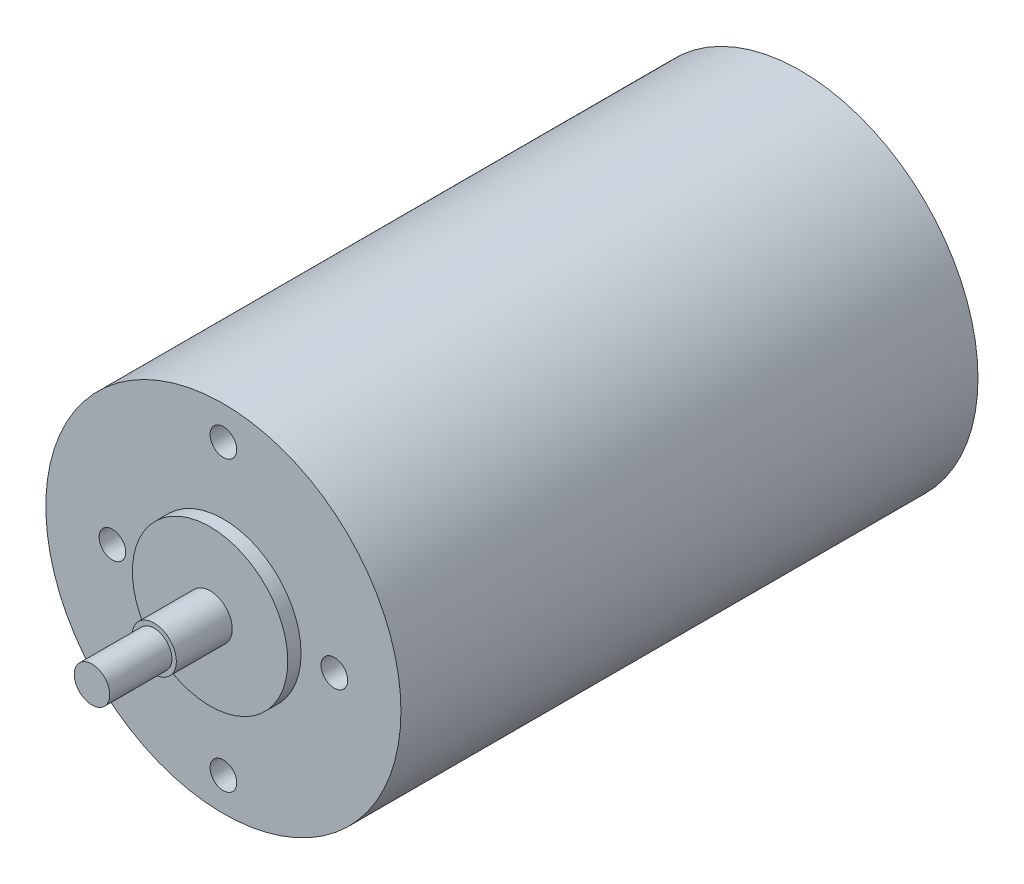
ISO-10303-21;
HEADER;
FILE_DESCRIPTION(('STEP AP214'),'2;1');
FILE_NAME('part.step','',(''),(''),'','','');
FILE_SCHEMA(('AUTOMOTIVE_DESIGN { 1 0 10303 214 1 1 1 1 }'));
ENDSEC;
DATA;
#1=APPLICATION_CONTEXT('core data for automotive mechanical design processes');
#2=APPLICATION_PROTOCOL_DEFINITION('international standard','automotive_design',2000,#1);
#3=PRODUCT_CONTEXT('',#1,'mechanical');
#4=PRODUCT('Part','Part','',(#3));
#5=PRODUCT_RELATED_PRODUCT_CATEGORY('part','',(#4));
#6=PRODUCT_DEFINITION_FORMATION('','',#4);
#7=PRODUCT_DEFINITION_CONTEXT('part definition',#1,'design');
#8=PRODUCT_DEFINITION('design','',#6,#7);
#9=PRODUCT_DEFINITION_SHAPE('','',#8);
#10=(LENGTH_UNIT() NAMED_UNIT(*) SI_UNIT(.MILLI.,.METRE.));
#11=(NAMED_UNIT(*) PLANE_ANGLE_UNIT() SI_UNIT($,.RADIAN.));
#12=(NAMED_UNIT(*) SI_UNIT($,.STERADIAN.) SOLID_ANGLE_UNIT());
#13=UNCERTAINTY_MEASURE_WITH_UNIT(LENGTH_MEASURE(1.E-05),#10,'distance_accuracy_value','');
#14=(GEOMETRIC_REPRESENTATION_CONTEXT(3) GLOBAL_UNCERTAINTY_ASSIGNED_CONTEXT((#13)) GLOBAL_UNIT_ASSIGNED_CONTEXT((#10,
#11,#12)) REPRESENTATION_CONTEXT('',''));
#15=CARTESIAN_POINT('',(0.,0.,0.));
#16=DIRECTION('',(0.,0.,1.));
#17=DIRECTION('',(1.,0.,0.));
#18=AXIS2_PLACEMENT_3D('',#15,#16,#17);
#19=CARTESIAN_POINT('',(0.,0.,-1.5));
#20=DIRECTION('',(0.,0.,-1.));
#21=DIRECTION('',(-1.,0.,0.));
#22=AXIS2_PLACEMENT_3D('',#19,#20,#21);
#23=PLANE('',#22);
#24=CARTESIAN_POINT('',(0.,0.,-1.5));
#25=DIRECTION('',(0.,0.,-1.));
#26=DIRECTION('',(-1.,0.,0.));
#27=AXIS2_PLACEMENT_3D('',#24,#25,#26);
#28=CIRCLE('',#27,8.75);
#29=CARTESIAN_POINT('',(-8.75,0.,-1.5));
#30=VERTEX_POINT('',#29);
#31=EDGE_CURVE('E46',#30,#30,#28,.T.);
#32=ORIENTED_EDGE('',*,*,#31,.T.);
#33=EDGE_LOOP('',(#32));
#34=FACE_BOUND('',#33,.T.);
#35=CARTESIAN_POINT('',(0.,0.,-1.5));
#36=DIRECTION('',(0.,0.,-1.));
#37=DIRECTION('',(-1.,0.,0.));
#38=AXIS2_PLACEMENT_3D('',#35,#36,#37);
#39=CIRCLE('',#38,2.5);
#40=CARTESIAN_POINT('',(-2.5,0.,-1.5));
#41=VERTEX_POINT('',#40);
#42=EDGE_CURVE('E69',#41,#41,#39,.T.);
#43=ORIENTED_EDGE('',*,*,#42,.F.);
#44=EDGE_LOOP('',(#43));
#45=FACE_BOUND('',#44,.T.);
#46=ADVANCED_FACE('F30',(#34,#45),#23,.T.);
#47=CARTESIAN_POINT('',(0.,0.,72.8));
#48=DIRECTION('',(0.,0.,1.));
#49=DIRECTION('',(1.,0.,0.));
#50=AXIS2_PLACEMENT_3D('',#47,#48,#49);
#51=PLANE('',#50);
#52=CARTESIAN_POINT('',(0.,0.,72.8));
#53=DIRECTION('',(0.,0.,1.));
#54=DIRECTION('',(1.,0.,0.));
#55=AXIS2_PLACEMENT_3D('',#52,#53,#54);
#56=CIRCLE('',#55,2.5);
#57=CARTESIAN_POINT('',(2.5,0.,72.8));
#58=VERTEX_POINT('',#57);
#59=EDGE_CURVE('E54',#58,#58,#56,.T.);
#60=ORIENTED_EDGE('',*,*,#59,.T.);
#61=EDGE_LOOP('',(#60));
#62=FACE_BOUND('',#61,.T.);
#63=CARTESIAN_POINT('',(0.,0.,72.8));
#64=DIRECTION('',(0.,0.,1.));
#65=DIRECTION('',(1.,0.,0.));
#66=AXIS2_PLACEMENT_3D('',#63,#64,#65);
#67=CIRCLE('',#66,2.);
#68=CARTESIAN_POINT('',(2.,0.,72.8));
#69=VERTEX_POINT('',#68);
#70=EDGE_CURVE('E63',#69,#69,#67,.T.);
#71=ORIENTED_EDGE('',*,*,#70,.F.);
#72=EDGE_LOOP('',(#71));
#73=FACE_BOUND('',#72,.T.);
#74=ADVANCED_FACE('F141',(#62,#73),#51,.T.);
#75=CARTESIAN_POINT('',(0.,0.,66.5));
#76=DIRECTION('',(0.,0.,1.));
#77=DIRECTION('',(1.,0.,0.));
#78=AXIS2_PLACEMENT_3D('',#75,#76,#77);
#79=PLANE('',#78);
#80=CARTESIAN_POINT('',(0.,0.,66.5));
#81=DIRECTION('',(0.,0.,1.));
#82=DIRECTION('',(1.,0.,0.));
#83=AXIS2_PLACEMENT_3D('',#80,#81,#82);
#84=CIRCLE('',#83,8.75);
#85=CARTESIAN_POINT('',(8.75,0.,66.5));
#86=VERTEX_POINT('',#85);
#87=EDGE_CURVE('E50',#86,#86,#84,.T.);
#88=ORIENTED_EDGE('',*,*,#87,.T.);
#89=EDGE_LOOP('',(#88));
#90=FACE_BOUND('',#89,.T.);
#91=CARTESIAN_POINT('',(0.,0.,66.5));
#92=DIRECTION('',(0.,0.,1.));
#93=DIRECTION('',(1.,0.,0.));
#94=AXIS2_PLACEMENT_3D('',#91,#92,#93);
#95=CIRCLE('',#94,2.5);
#96=CARTESIAN_POINT('',(2.5,0.,66.5));
#97=VERTEX_POINT('',#96);
#98=EDGE_CURVE('E57',#97,#97,#95,.T.);
#99=ORIENTED_EDGE('',*,*,#98,.F.);
#100=EDGE_LOOP('',(#99));
#101=FACE_BOUND('',#100,.T.);
#102=ADVANCED_FACE('F112',(#90,#101),#79,.T.);
#103=CARTESIAN_POINT('',(0.,0.,65.));
#104=DIRECTION('',(0.,0.,1.));
#105=DIRECTION('',(1.,0.,0.));
#106=AXIS2_PLACEMENT_3D('',#103,#104,#105);
#107=PLANE('',#106);
#108=CARTESIAN_POINT('',(0.,-16.25,65.));
#109=DIRECTION('',(0.,0.,1.));
#110=DIRECTION('',(1.,0.,0.));
#111=AXIS2_PLACEMENT_3D('',#108,#109,#110);
#112=CIRCLE('',#111,1.5);
#113=CARTESIAN_POINT('',(1.5,-16.25,65.));
#114=VERTEX_POINT('',#113);
#115=EDGE_CURVE('E93',#114,#114,#112,.T.);
#116=ORIENTED_EDGE('',*,*,#115,.F.);
#117=EDGE_LOOP('',(#116));
#118=FACE_BOUND('',#117,.T.);
#119=CARTESIAN_POINT('',(0.,16.25,65.));
#120=DIRECTION('',(0.,0.,1.));
#121=DIRECTION('',(1.,0.,0.));
#122=AXIS2_PLACEMENT_3D('',#119,#120,#121);
#123=CIRCLE('',#122,1.5);
#124=CARTESIAN_POINT('',(1.5,16.25,65.));
#125=VERTEX_POINT('',#124);
#126=EDGE_CURVE('E87',#125,#125,#123,.T.);
#127=ORIENTED_EDGE('',*,*,#126,.F.);
#128=EDGE_LOOP('',(#127));
#129=FACE_BOUND('',#128,.T.);
#130=CARTESIAN_POINT('',(12.5,0.,65.));
#131=DIRECTION('',(0.,0.,1.));
#132=DIRECTION('',(1.,0.,0.));
#133=AXIS2_PLACEMENT_3D('',#130,#131,#132);
#134=CIRCLE('',#133,1.5);
#135=CARTESIAN_POINT('',(14.,0.,65.));
#136=VERTEX_POINT('',#135);
#137=EDGE_CURVE('E81',#136,#136,#134,.T.);
#138=ORIENTED_EDGE('',*,*,#137,.F.);
#139=EDGE_LOOP('',(#138));
#140=FACE_BOUND('',#139,.T.);
#141=CARTESIAN_POINT('',(-12.5,0.,65.));
#142=DIRECTION('',(0.,0.,1.));
#143=DIRECTION('',(1.,0.,0.));
#144=AXIS2_PLACEMENT_3D('',#141,#142,#143);
#145=CIRCLE('',#144,1.5);
#146=CARTESIAN_POINT('',(-11.,0.,65.));
#147=VERTEX_POINT('',#146);
#148=EDGE_CURVE('E75',#147,#147,#145,.T.);
#149=ORIENTED_EDGE('',*,*,#148,.F.);
#150=EDGE_LOOP('',(#149));
#151=FACE_BOUND('',#150,.T.);
#152=CARTESIAN_POINT('',(0.,0.,65.));
#153=DIRECTION('',(0.,0.,1.));
#154=DIRECTION('',(1.,0.,0.));
#155=AXIS2_PLACEMENT_3D('',#152,#153,#154);
#156=CIRCLE('',#155,20.);
#157=CARTESIAN_POINT('',(20.,0.,65.));
#158=VERTEX_POINT('',#157);
#159=EDGE_CURVE('E37',#158,#158,#156,.T.);
#160=ORIENTED_EDGE('',*,*,#159,.T.);
#161=EDGE_LOOP('',(#160));
#162=FACE_BOUND('',#161,.T.);
#163=CARTESIAN_POINT('',(0.,0.,65.));
#164=DIRECTION('',(0.,0.,1.));
#165=DIRECTION('',(1.,0.,0.));
#166=AXIS2_PLACEMENT_3D('',#163,#164,#165);
#167=CIRCLE('',#166,8.75);
#168=CARTESIAN_POINT('',(8.75,0.,65.));
#169=VERTEX_POINT('',#168);
#170=EDGE_CURVE('E51',#169,#169,#167,.T.);
#171=ORIENTED_EDGE('',*,*,#170,.F.);
#172=EDGE_LOOP('',(#171));
#173=FACE_BOUND('',#172,.T.);
#174=ADVANCED_FACE('F108',(#118,#129,#140,#151,#162,#173),#107,.T.);
#175=CARTESIAN_POINT('',(0.,0.,0.));
#176=DIRECTION('',(0.,0.,1.));
#177=DIRECTION('',(1.,0.,0.));
#178=AXIS2_PLACEMENT_3D('',#175,#176,#177);
#179=PLANE('',#178);
#180=CARTESIAN_POINT('',(0.,0.,0.));
#181=DIRECTION('',(0.,0.,1.));
#182=DIRECTION('',(1.,0.,0.));
#183=AXIS2_PLACEMENT_3D('',#180,#181,#182);
#184=CIRCLE('',#183,20.);
#185=CARTESIAN_POINT('',(20.,0.,0.));
#186=VERTEX_POINT('',#185);
#187=EDGE_CURVE('E41',#186,#186,#184,.T.);
#188=ORIENTED_EDGE('',*,*,#187,.F.);
#189=EDGE_LOOP('',(#188));
#190=FACE_BOUND('',#189,.T.);
#191=CARTESIAN_POINT('',(0.,0.,0.));
#192=DIRECTION('',(0.,0.,1.));
#193=DIRECTION('',(1.,0.,0.));
#194=AXIS2_PLACEMENT_3D('',#191,#192,#193);
#195=CIRCLE('',#194,8.75);
#196=CARTESIAN_POINT('',(8.75,0.,0.));
#197=VERTEX_POINT('',#196);
#198=EDGE_CURVE('E10',#197,#197,#195,.F.);
#199=ORIENTED_EDGE('',*,*,#198,.F.);
#200=EDGE_LOOP('',(#199));
#201=FACE_BOUND('',#200,.T.);
#202=ADVANCED_FACE('F111',(#190,#201),#179,.F.);
#203=CARTESIAN_POINT('',(0.,0.,65.));
#204=DIRECTION('',(0.,0.,-1.));
#205=DIRECTION('',(-1.,0.,0.));
#206=AXIS2_PLACEMENT_3D('',#203,#204,#205);
#207=CYLINDRICAL_SURFACE('',#206,20.);
#208=ORIENTED_EDGE('',*,*,#159,.F.);
#209=EDGE_LOOP('',(#208));
#210=FACE_BOUND('',#209,.T.);
#211=ORIENTED_EDGE('',*,*,#187,.T.);
#212=EDGE_LOOP('',(#211));
#213=FACE_BOUND('',#212,.T.);
#214=ADVANCED_FACE('F32',(#210,#213),#207,.T.);
#215=CARTESIAN_POINT('',(0.,0.,-1.5));
#216=DIRECTION('',(0.,0.,1.));
#217=DIRECTION('',(1.,0.,0.));
#218=AXIS2_PLACEMENT_3D('',#215,#216,#217);
#219=CYLINDRICAL_SURFACE('',#218,8.75);
#220=ORIENTED_EDGE('',*,*,#31,.F.);
#221=EDGE_LOOP('',(#220));
#222=FACE_BOUND('',#221,.T.);
#223=ORIENTED_EDGE('',*,*,#198,.T.);
#224=EDGE_LOOP('',(#223));
#225=FACE_BOUND('',#224,.T.);
#226=ADVANCED_FACE('F125',(#222,#225),#219,.T.);
#227=CARTESIAN_POINT('',(0.,0.,66.5));
#228=DIRECTION('',(0.,0.,-1.));
#229=DIRECTION('',(-1.,0.,0.));
#230=AXIS2_PLACEMENT_3D('',#227,#228,#229);
#231=CYLINDRICAL_SURFACE('',#230,8.75);
#232=ORIENTED_EDGE('',*,*,#87,.F.);
#233=EDGE_LOOP('',(#232));
#234=FACE_BOUND('',#233,.T.);
#235=ORIENTED_EDGE('',*,*,#170,.T.);
#236=EDGE_LOOP('',(#235));
#237=FACE_BOUND('',#236,.T.);
#238=ADVANCED_FACE('F122',(#234,#237),#231,.T.);
#239=CARTESIAN_POINT('',(0.,0.,72.8));
#240=DIRECTION('',(0.,0.,-1.));
#241=DIRECTION('',(-1.,0.,0.));
#242=AXIS2_PLACEMENT_3D('',#239,#240,#241);
#243=CYLINDRICAL_SURFACE('',#242,2.5);
#244=ORIENTED_EDGE('',*,*,#59,.F.);
#245=EDGE_LOOP('',(#244));
#246=FACE_BOUND('',#245,.T.);
#247=ORIENTED_EDGE('',*,*,#98,.T.);
#248=EDGE_LOOP('',(#247));
#249=FACE_BOUND('',#248,.T.);
#250=ADVANCED_FACE('F124',(#246,#249),#243,.T.);
#251=CARTESIAN_POINT('',(0.,0.,79.8));
#252=DIRECTION('',(0.,0.,-1.));
#253=DIRECTION('',(-1.,0.,0.));
#254=AXIS2_PLACEMENT_3D('',#251,#252,#253);
#255=CYLINDRICAL_SURFACE('',#254,2.);
#256=CARTESIAN_POINT('',(0.,0.,79.8));
#257=DIRECTION('',(0.,0.,1.));
#258=DIRECTION('',(1.,0.,0.));
#259=AXIS2_PLACEMENT_3D('',#256,#257,#258);
#260=CIRCLE('',#259,2.);
#261=CARTESIAN_POINT('',(2.,0.,79.8));
#262=VERTEX_POINT('',#261);
#263=EDGE_CURVE('E60',#262,#262,#260,.T.);
#264=ORIENTED_EDGE('',*,*,#263,.F.);
#265=EDGE_LOOP('',(#264));
#266=FACE_BOUND('',#265,.T.);
#267=ORIENTED_EDGE('',*,*,#70,.T.);
#268=EDGE_LOOP('',(#267));
#269=FACE_BOUND('',#268,.T.);
#270=ADVANCED_FACE('F132',(#266,#269),#255,.T.);
#271=CARTESIAN_POINT('',(0.,0.,79.8));
#272=DIRECTION('',(0.,0.,1.));
#273=DIRECTION('',(1.,0.,0.));
#274=AXIS2_PLACEMENT_3D('',#271,#272,#273);
#275=PLANE('',#274);
#276=ORIENTED_EDGE('',*,*,#263,.T.);
#277=EDGE_LOOP('',(#276));
#278=FACE_BOUND('',#277,.T.);
#279=ADVANCED_FACE('F200',(#278),#275,.T.);
#280=CARTESIAN_POINT('',(0.,0.,-2.5));
#281=DIRECTION('',(0.,0.,1.));
#282=DIRECTION('',(1.,0.,0.));
#283=AXIS2_PLACEMENT_3D('',#280,#281,#282);
#284=CYLINDRICAL_SURFACE('',#283,2.5);
#285=CARTESIAN_POINT('',(0.,0.,-2.5));
#286=DIRECTION('',(0.,0.,-1.));
#287=DIRECTION('',(-1.,0.,0.));
#288=AXIS2_PLACEMENT_3D('',#285,#286,#287);
#289=CIRCLE('',#288,2.5);
#290=CARTESIAN_POINT('',(-2.5,0.,-2.5));
#291=VERTEX_POINT('',#290);
#292=EDGE_CURVE('E66',#291,#291,#289,.T.);
#293=ORIENTED_EDGE('',*,*,#292,.F.);
#294=EDGE_LOOP('',(#293));
#295=FACE_BOUND('',#294,.T.);
#296=ORIENTED_EDGE('',*,*,#42,.T.);
#297=EDGE_LOOP('',(#296));
#298=FACE_BOUND('',#297,.T.);
#299=ADVANCED_FACE('F209',(#295,#298),#284,.T.);
#300=CARTESIAN_POINT('',(0.,0.,-2.5));
#301=DIRECTION('',(0.,0.,-1.));
#302=DIRECTION('',(-1.,0.,0.));
#303=AXIS2_PLACEMENT_3D('',#300,#301,#302);
#304=PLANE('',#303);
#305=ORIENTED_EDGE('',*,*,#292,.T.);
#306=EDGE_LOOP('',(#305));
#307=FACE_BOUND('',#306,.T.);
#308=ADVANCED_FACE('F224',(#307),#304,.T.);
#309=CARTESIAN_POINT('',(-12.5,0.,61.));
#310=DIRECTION('',(0.,0.,1.));
#311=DIRECTION('',(1.,0.,0.));
#312=AXIS2_PLACEMENT_3D('',#309,#310,#311);
#313=CYLINDRICAL_SURFACE('',#312,1.5);
#314=CARTESIAN_POINT('',(-12.5,0.,61.));
#315=DIRECTION('',(0.,0.,1.));
#316=DIRECTION('',(1.,0.,0.));
#317=AXIS2_PLACEMENT_3D('',#314,#315,#316);
#318=CIRCLE('',#317,1.5);
#319=CARTESIAN_POINT('',(-11.,0.,61.));
#320=VERTEX_POINT('',#319);
#321=EDGE_CURVE('E72',#320,#320,#318,.T.);
#322=ORIENTED_EDGE('',*,*,#321,.F.);
#323=EDGE_LOOP('',(#322));
#324=FACE_BOUND('',#323,.T.);
#325=ORIENTED_EDGE('',*,*,#148,.T.);
#326=EDGE_LOOP('',(#325));
#327=FACE_BOUND('',#326,.T.);
#328=ADVANCED_FACE('F234',(#324,#327),#313,.F.);
#329=CARTESIAN_POINT('',(-12.5,0.,61.));
#330=DIRECTION('',(0.,0.,1.));
#331=DIRECTION('',(1.,0.,0.));
#332=AXIS2_PLACEMENT_3D('',#329,#330,#331);
#333=PLANE('',#332);
#334=ORIENTED_EDGE('',*,*,#321,.T.);
#335=EDGE_LOOP('',(#334));
#336=FACE_BOUND('',#335,.T.);
#337=ADVANCED_FACE('F244',(#336),#333,.T.);
#338=CARTESIAN_POINT('',(12.5,0.,61.));
#339=DIRECTION('',(0.,0.,1.));
#340=DIRECTION('',(1.,0.,0.));
#341=AXIS2_PLACEMENT_3D('',#338,#339,#340);
#342=CYLINDRICAL_SURFACE('',#341,1.5);
#343=CARTESIAN_POINT('',(12.5,0.,61.));
#344=DIRECTION('',(0.,0.,1.));
#345=DIRECTION('',(1.,0.,0.));
#346=AXIS2_PLACEMENT_3D('',#343,#344,#345);
#347=CIRCLE('',#346,1.5);
#348=CARTESIAN_POINT('',(14.,0.,61.));
#349=VERTEX_POINT('',#348);
#350=EDGE_CURVE('E78',#349,#349,#347,.T.);
#351=ORIENTED_EDGE('',*,*,#350,.F.);
#352=EDGE_LOOP('',(#351));
#353=FACE_BOUND('',#352,.T.);
#354=ORIENTED_EDGE('',*,*,#137,.T.);
#355=EDGE_LOOP('',(#354));
#356=FACE_BOUND('',#355,.T.);
#357=ADVANCED_FACE('F254',(#353,#356),#342,.F.);
#358=CARTESIAN_POINT('',(12.5,0.,61.));
#359=DIRECTION('',(0.,0.,1.));
#360=DIRECTION('',(1.,0.,0.));
#361=AXIS2_PLACEMENT_3D('',#358,#359,#360);
#362=PLANE('',#361);
#363=ORIENTED_EDGE('',*,*,#350,.T.);
#364=EDGE_LOOP('',(#363));
#365=FACE_BOUND('',#364,.T.);
#366=ADVANCED_FACE('F264',(#365),#362,.T.);
#367=CARTESIAN_POINT('',(0.,16.25,61.));
#368=DIRECTION('',(0.,0.,1.));
#369=DIRECTION('',(1.,0.,0.));
#370=AXIS2_PLACEMENT_3D('',#367,#368,#369);
#371=CYLINDRICAL_SURFACE('',#370,1.5);
#372=CARTESIAN_POINT('',(0.,16.25,61.));
#373=DIRECTION('',(0.,0.,1.));
#374=DIRECTION('',(1.,0.,0.));
#375=AXIS2_PLACEMENT_3D('',#372,#373,#374);
#376=CIRCLE('',#375,1.5);
#377=CARTESIAN_POINT('',(1.5,16.25,61.));
#378=VERTEX_POINT('',#377);
#379=EDGE_CURVE('E84',#378,#378,#376,.T.);
#380=ORIENTED_EDGE('',*,*,#379,.F.);
#381=EDGE_LOOP('',(#380));
#382=FACE_BOUND('',#381,.T.);
#383=ORIENTED_EDGE('',*,*,#126,.T.);
#384=EDGE_LOOP('',(#383));
#385=FACE_BOUND('',#384,.T.);
#386=ADVANCED_FACE('F274',(#382,#385),#371,.F.);
#387=CARTESIAN_POINT('',(0.,16.25,61.));
#388=DIRECTION('',(0.,0.,1.));
#389=DIRECTION('',(1.,0.,0.));
#390=AXIS2_PLACEMENT_3D('',#387,#388,#389);
#391=PLANE('',#390);
#392=ORIENTED_EDGE('',*,*,#379,.T.);
#393=EDGE_LOOP('',(#392));
#394=FACE_BOUND('',#393,.T.);
#395=ADVANCED_FACE('F104',(#394),#391,.T.);
#396=CARTESIAN_POINT('',(0.,-16.25,61.));
#397=DIRECTION('',(0.,0.,1.));
#398=DIRECTION('',(1.,0.,0.));
#399=AXIS2_PLACEMENT_3D('',#396,#397,#398);
#400=CYLINDRICAL_SURFACE('',#399,1.5);
#401=CARTESIAN_POINT('',(0.,-16.25,61.));
#402=DIRECTION('',(0.,0.,1.));
#403=DIRECTION('',(1.,0.,0.));
#404=AXIS2_PLACEMENT_3D('',#401,#402,#403);
#405=CIRCLE('',#404,1.5);
#406=CARTESIAN_POINT('',(1.5,-16.25,61.));
#407=VERTEX_POINT('',#406);
#408=EDGE_CURVE('E90',#407,#407,#405,.T.);
#409=ORIENTED_EDGE('',*,*,#408,.F.);
#410=EDGE_LOOP('',(#409));
#411=FACE_BOUND('',#410,.T.);
#412=ORIENTED_EDGE('',*,*,#115,.T.);
#413=EDGE_LOOP('',(#412));
#414=FACE_BOUND('',#413,.T.);
#415=ADVANCED_FACE('F101',(#411,#414),#400,.F.);
#416=CARTESIAN_POINT('',(0.,-16.25,61.));
#417=DIRECTION('',(0.,0.,1.));
#418=DIRECTION('',(1.,0.,0.));
#419=AXIS2_PLACEMENT_3D('',#416,#417,#418);
#420=PLANE('',#419);
#421=ORIENTED_EDGE('',*,*,#408,.T.);
#422=EDGE_LOOP('',(#421));
#423=FACE_BOUND('',#422,.T.);
#424=ADVANCED_FACE('F99',(#423),#420,.T.);
#425=CLOSED_SHELL('',(#46,#74,#102,#174,#202,#214,#226,#238,#250,#270,#279,#299,#308,#328,#337,
#357,#366,#386,#395,#415,#424));
#426=MANIFOLD_SOLID_BREP('B2',#425);
#427=ADVANCED_BREP_SHAPE_REPRESENTATION('',(#18,#426),#14);
#428=SHAPE_DEFINITION_REPRESENTATION(#9,#427);
ENDSEC;
END-ISO-10303-21;
